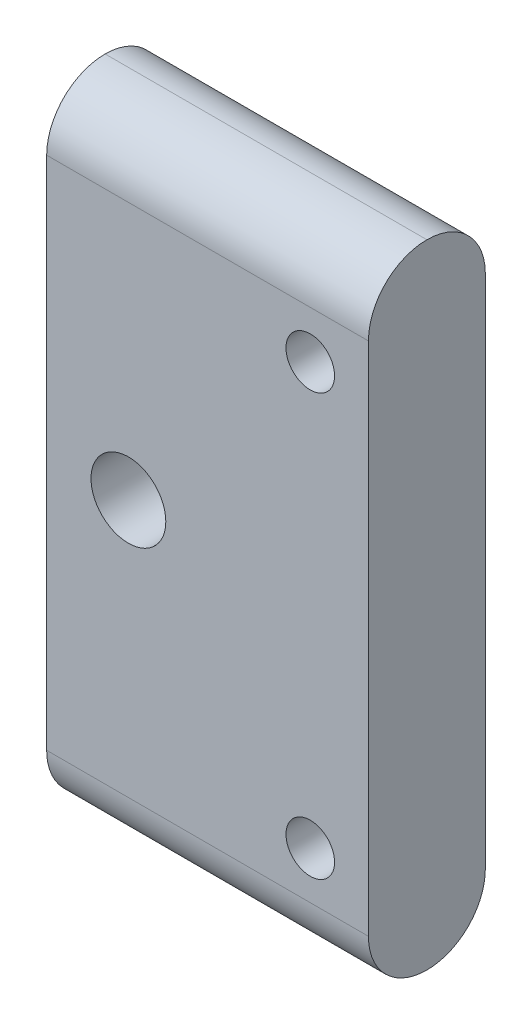
ISO-10303-21;
HEADER;
FILE_DESCRIPTION(('STEP AP214'),'2;1');
FILE_NAME('part.step','',(''),(''),'','','');
FILE_SCHEMA(('AUTOMOTIVE_DESIGN { 1 0 10303 214 1 1 1 1 }'));
ENDSEC;
DATA;
#1=APPLICATION_CONTEXT('core data for automotive mechanical design processes');
#2=APPLICATION_PROTOCOL_DEFINITION('international standard','automotive_design',2000,#1);
#3=PRODUCT_CONTEXT('',#1,'mechanical');
#4=PRODUCT('Part','Part','',(#3));
#5=PRODUCT_RELATED_PRODUCT_CATEGORY('part','',(#4));
#6=PRODUCT_DEFINITION_FORMATION('','',#4);
#7=PRODUCT_DEFINITION_CONTEXT('part definition',#1,'design');
#8=PRODUCT_DEFINITION('design','',#6,#7);
#9=PRODUCT_DEFINITION_SHAPE('','',#8);
#10=(LENGTH_UNIT() NAMED_UNIT(*) SI_UNIT(.MILLI.,.METRE.));
#11=(NAMED_UNIT(*) PLANE_ANGLE_UNIT() SI_UNIT($,.RADIAN.));
#12=(NAMED_UNIT(*) SI_UNIT($,.STERADIAN.) SOLID_ANGLE_UNIT());
#13=UNCERTAINTY_MEASURE_WITH_UNIT(LENGTH_MEASURE(1.E-05),#10,'distance_accuracy_value','');
#14=(GEOMETRIC_REPRESENTATION_CONTEXT(3) GLOBAL_UNCERTAINTY_ASSIGNED_CONTEXT((#13)) GLOBAL_UNIT_ASSIGNED_CONTEXT((#10,
#11,#12)) REPRESENTATION_CONTEXT('',''));
#15=CARTESIAN_POINT('',(0.,0.,0.));
#16=DIRECTION('',(0.,0.,1.));
#17=DIRECTION('',(1.,0.,0.));
#18=AXIS2_PLACEMENT_3D('',#15,#16,#17);
#19=CARTESIAN_POINT('',(174.8183702,174.2591892,-15.875));
#20=DIRECTION('',(1.,0.,0.));
#21=DIRECTION('',(0.,0.,-1.));
#22=AXIS2_PLACEMENT_3D('',#19,#20,#21);
#23=PLANE('',#22);
#24=CARTESIAN_POINT('',(174.8183702,96.296710524297,-7.9375));
#25=DIRECTION('',(1.,0.,0.));
#26=DIRECTION('',(0.,-1.,0.));
#27=AXIS2_PLACEMENT_3D('',#24,#25,#26);
#28=ELLIPSE('',#27,7.93750192429702,7.9375);
#29=CARTESIAN_POINT('',(174.8183702,96.296710524297,0.));
#30=VERTEX_POINT('',#29);
#31=CARTESIAN_POINT('',(174.8183702,88.3592086,-7.9375));
#32=VERTEX_POINT('',#31);
#33=EDGE_CURVE('E94',#30,#32,#28,.T.);
#34=ORIENTED_EDGE('',*,*,#33,.T.);
#35=CARTESIAN_POINT('',(174.8183702,96.296710524297,-7.9375));
#36=DIRECTION('',(1.,0.,0.));
#37=DIRECTION('',(0.,1.,0.));
#38=AXIS2_PLACEMENT_3D('',#35,#36,#37);
#39=ELLIPSE('',#38,7.93750192429702,7.9375);
#40=CARTESIAN_POINT('',(174.8183702,96.296710524297,-15.875));
#41=VERTEX_POINT('',#40);
#42=EDGE_CURVE('E104',#32,#41,#39,.T.);
#43=ORIENTED_EDGE('',*,*,#42,.T.);
#44=DIRECTION('',(0.,1.,0.));
#45=VECTOR('',#44,1.);
#46=CARTESIAN_POINT('',(174.8183702,174.2591892,-15.875));
#47=LINE('',#46,#45);
#48=CARTESIAN_POINT('',(174.8183702,166.3216892,-15.875));
#49=VERTEX_POINT('',#48);
#50=EDGE_CURVE('E135',#41,#49,#47,.T.);
#51=ORIENTED_EDGE('',*,*,#50,.T.);
#52=CARTESIAN_POINT('',(174.8183702,166.3216892,-7.9375));
#53=DIRECTION('',(1.,0.,0.));
#54=DIRECTION('',(0.,0.,-1.));
#55=AXIS2_PLACEMENT_3D('',#52,#53,#54);
#56=CIRCLE('',#55,7.9375);
#57=CARTESIAN_POINT('',(174.8183702,174.2591892,-7.9375));
#58=VERTEX_POINT('',#57);
#59=EDGE_CURVE('E105',#49,#58,#56,.T.);
#60=ORIENTED_EDGE('',*,*,#59,.T.);
#61=CARTESIAN_POINT('',(174.8183702,166.3216892,-7.9375));
#62=DIRECTION('',(1.,0.,0.));
#63=DIRECTION('',(0.,0.,-1.));
#64=AXIS2_PLACEMENT_3D('',#61,#62,#63);
#65=CIRCLE('',#64,7.9375);
#66=CARTESIAN_POINT('',(174.8183702,166.3216892,0.));
#67=VERTEX_POINT('',#66);
#68=EDGE_CURVE('E97',#58,#67,#65,.T.);
#69=ORIENTED_EDGE('',*,*,#68,.T.);
#70=DIRECTION('',(0.,1.,0.));
#71=VECTOR('',#70,1.);
#72=CARTESIAN_POINT('',(174.8183702,174.2591892,0.));
#73=LINE('',#72,#71);
#74=EDGE_CURVE('E88',#30,#67,#73,.T.);
#75=ORIENTED_EDGE('',*,*,#74,.F.);
#76=EDGE_LOOP('',(#34,#43,#51,#60,#69,#75));
#77=FACE_BOUND('',#76,.T.);
#78=ADVANCED_FACE('F31',(#77),#23,.T.);
#79=CARTESIAN_POINT('',(131.1183814,88.3896378,-15.875));
#80=DIRECTION('',(-1.,0.,0.));
#81=DIRECTION('',(0.,0.,1.));
#82=AXIS2_PLACEMENT_3D('',#79,#80,#81);
#83=PLANE('',#82);
#84=DIRECTION('',(0.,-1.,0.));
#85=VECTOR('',#84,1.);
#86=CARTESIAN_POINT('',(131.1183814,88.3896378,-15.875));
#87=LINE('',#86,#85);
#88=CARTESIAN_POINT('',(131.1183814,166.3216892,-15.875));
#89=VERTEX_POINT('',#88);
#90=CARTESIAN_POINT('',(131.1183814,96.327139724297,-15.875));
#91=VERTEX_POINT('',#90);
#92=EDGE_CURVE('E134',#89,#91,#87,.T.);
#93=ORIENTED_EDGE('',*,*,#92,.T.);
#94=CARTESIAN_POINT('',(131.1183814,96.327139724297,-7.9375));
#95=DIRECTION('',(-1.,0.,0.));
#96=DIRECTION('',(0.,1.,0.));
#97=AXIS2_PLACEMENT_3D('',#94,#95,#96);
#98=ELLIPSE('',#97,7.93750192429702,7.9375);
#99=CARTESIAN_POINT('',(131.1183814,88.3896378,-7.9375));
#100=VERTEX_POINT('',#99);
#101=EDGE_CURVE('E48',#91,#100,#98,.T.);
#102=ORIENTED_EDGE('',*,*,#101,.T.);
#103=CARTESIAN_POINT('',(131.1183814,96.327139724297,-7.9375));
#104=DIRECTION('',(-1.,0.,0.));
#105=DIRECTION('',(0.,-1.,0.));
#106=AXIS2_PLACEMENT_3D('',#103,#104,#105);
#107=ELLIPSE('',#106,7.93750192429702,7.9375);
#108=CARTESIAN_POINT('',(131.1183814,96.327139724297,0.));
#109=VERTEX_POINT('',#108);
#110=EDGE_CURVE('E120',#100,#109,#107,.T.);
#111=ORIENTED_EDGE('',*,*,#110,.T.);
#112=DIRECTION('',(0.,-1.,0.));
#113=VECTOR('',#112,1.);
#114=CARTESIAN_POINT('',(131.1183814,88.3896378,0.));
#115=LINE('',#114,#113);
#116=CARTESIAN_POINT('',(131.1183814,166.3216892,0.));
#117=VERTEX_POINT('',#116);
#118=EDGE_CURVE('E90',#117,#109,#115,.T.);
#119=ORIENTED_EDGE('',*,*,#118,.F.);
#120=CARTESIAN_POINT('',(131.1183814,166.3216892,-7.9375));
#121=DIRECTION('',(-1.,0.,0.));
#122=DIRECTION('',(0.,0.,1.));
#123=AXIS2_PLACEMENT_3D('',#120,#121,#122);
#124=CIRCLE('',#123,7.9375);
#125=CARTESIAN_POINT('',(131.1183814,174.2591892,-7.9375));
#126=VERTEX_POINT('',#125);
#127=EDGE_CURVE('E55',#117,#126,#124,.T.);
#128=ORIENTED_EDGE('',*,*,#127,.T.);
#129=CARTESIAN_POINT('',(131.1183814,166.3216892,-7.9375));
#130=DIRECTION('',(-1.,0.,0.));
#131=DIRECTION('',(0.,0.,1.));
#132=AXIS2_PLACEMENT_3D('',#129,#130,#131);
#133=CIRCLE('',#132,7.9375);
#134=EDGE_CURVE('E118',#126,#89,#133,.T.);
#135=ORIENTED_EDGE('',*,*,#134,.T.);
#136=EDGE_LOOP('',(#93,#102,#111,#119,#128,#135));
#137=FACE_BOUND('',#136,.T.);
#138=ADVANCED_FACE('F184',(#137),#83,.T.);
#139=CARTESIAN_POINT('',(174.8183702,174.2591892,-15.875));
#140=DIRECTION('',(0.,0.,1.));
#141=DIRECTION('',(1.,0.,0.));
#142=AXIS2_PLACEMENT_3D('',#139,#140,#141);
#143=PLANE('',#142);
#144=CARTESIAN_POINT('',(142.2181814,131.3091862,-15.875));
#145=DIRECTION('',(0.,0.,1.));
#146=DIRECTION('',(1.,0.,0.));
#147=AXIS2_PLACEMENT_3D('',#144,#145,#146);
#148=CIRCLE('',#147,5.07999999999999);
#149=CARTESIAN_POINT('',(147.2981814,131.3091862,-15.875));
#150=VERTEX_POINT('',#149);
#151=EDGE_CURVE('E126',#150,#150,#148,.T.);
#152=ORIENTED_EDGE('',*,*,#151,.T.);
#153=EDGE_LOOP('',(#152));
#154=FACE_BOUND('',#153,.T.);
#155=CARTESIAN_POINT('',(166.9183606,102.7091926,-15.875));
#156=DIRECTION('',(0.,0.,1.));
#157=DIRECTION('',(1.,0.,0.));
#158=AXIS2_PLACEMENT_3D('',#155,#156,#157);
#159=CIRCLE('',#158,3.3000188);
#160=CARTESIAN_POINT('',(170.2183794,102.7091926,-15.875));
#161=VERTEX_POINT('',#160);
#162=EDGE_CURVE('E144',#161,#161,#159,.T.);
#163=ORIENTED_EDGE('',*,*,#162,.T.);
#164=EDGE_LOOP('',(#163));
#165=FACE_BOUND('',#164,.T.);
#166=CARTESIAN_POINT('',(166.9183606,159.9092052,-15.875));
#167=DIRECTION('',(0.,0.,1.));
#168=DIRECTION('',(1.,0.,0.));
#169=AXIS2_PLACEMENT_3D('',#166,#167,#168);
#170=CIRCLE('',#169,3.3000188);
#171=CARTESIAN_POINT('',(170.2183794,159.9092052,-15.875));
#172=VERTEX_POINT('',#171);
#173=EDGE_CURVE('E98',#172,#172,#170,.T.);
#174=ORIENTED_EDGE('',*,*,#173,.T.);
#175=EDGE_LOOP('',(#174));
#176=FACE_BOUND('',#175,.T.);
#177=ORIENTED_EDGE('',*,*,#50,.F.);
#178=DIRECTION('',(0.999999757568938,-0.000696320375785036,0.));
#179=VECTOR('',#178,1.);
#180=CARTESIAN_POINT('',(131.123908442983,96.3271358757034,-15.875));
#181=LINE('',#180,#179);
#182=EDGE_CURVE('E114',#41,#91,#181,.F.);
#183=ORIENTED_EDGE('',*,*,#182,.T.);
#184=ORIENTED_EDGE('',*,*,#92,.F.);
#185=DIRECTION('',(-1.,0.,0.));
#186=VECTOR('',#185,1.);
#187=CARTESIAN_POINT('',(174.8183702,166.3216892,-15.875));
#188=LINE('',#187,#186);
#189=EDGE_CURVE('E107',#89,#49,#188,.F.);
#190=ORIENTED_EDGE('',*,*,#189,.T.);
#191=EDGE_LOOP('',(#177,#183,#184,#190));
#192=FACE_BOUND('',#191,.T.);
#193=ADVANCED_FACE('F155',(#154,#165,#176,#192),#143,.F.);
#194=CARTESIAN_POINT('',(174.8183702,174.2591892,0.));
#195=DIRECTION('',(0.,0.,1.));
#196=DIRECTION('',(1.,0.,0.));
#197=AXIS2_PLACEMENT_3D('',#194,#195,#196);
#198=PLANE('',#197);
#199=CARTESIAN_POINT('',(142.2181814,131.3091862,0.));
#200=DIRECTION('',(0.,0.,1.));
#201=DIRECTION('',(1.,0.,0.));
#202=AXIS2_PLACEMENT_3D('',#199,#200,#201);
#203=CIRCLE('',#202,5.07999999999999);
#204=CARTESIAN_POINT('',(147.2981814,131.3091862,0.));
#205=VERTEX_POINT('',#204);
#206=EDGE_CURVE('E123',#205,#205,#203,.T.);
#207=ORIENTED_EDGE('',*,*,#206,.F.);
#208=EDGE_LOOP('',(#207));
#209=FACE_BOUND('',#208,.T.);
#210=CARTESIAN_POINT('',(166.9183606,102.7091926,0.));
#211=DIRECTION('',(0.,0.,1.));
#212=DIRECTION('',(1.,0.,0.));
#213=AXIS2_PLACEMENT_3D('',#210,#211,#212);
#214=CIRCLE('',#213,3.3000188);
#215=CARTESIAN_POINT('',(170.2183794,102.7091926,0.));
#216=VERTEX_POINT('',#215);
#217=EDGE_CURVE('E147',#216,#216,#214,.T.);
#218=ORIENTED_EDGE('',*,*,#217,.F.);
#219=EDGE_LOOP('',(#218));
#220=FACE_BOUND('',#219,.T.);
#221=CARTESIAN_POINT('',(166.9183606,159.9092052,0.));
#222=DIRECTION('',(0.,0.,1.));
#223=DIRECTION('',(1.,0.,0.));
#224=AXIS2_PLACEMENT_3D('',#221,#222,#223);
#225=CIRCLE('',#224,3.3000188);
#226=CARTESIAN_POINT('',(170.2183794,159.9092052,0.));
#227=VERTEX_POINT('',#226);
#228=EDGE_CURVE('E141',#227,#227,#225,.T.);
#229=ORIENTED_EDGE('',*,*,#228,.F.);
#230=EDGE_LOOP('',(#229));
#231=FACE_BOUND('',#230,.T.);
#232=ORIENTED_EDGE('',*,*,#118,.T.);
#233=DIRECTION('',(0.999999757568938,-0.000696320375785036,0.));
#234=VECTOR('',#233,1.);
#235=CARTESIAN_POINT('',(174.764083350712,96.2967483253455,0.));
#236=LINE('',#235,#234);
#237=EDGE_CURVE('E11',#109,#30,#236,.T.);
#238=ORIENTED_EDGE('',*,*,#237,.T.);
#239=ORIENTED_EDGE('',*,*,#74,.T.);
#240=DIRECTION('',(-1.,0.,0.));
#241=VECTOR('',#240,1.);
#242=CARTESIAN_POINT('',(174.8183702,166.3216892,0.));
#243=LINE('',#242,#241);
#244=EDGE_CURVE('E40',#67,#117,#243,.T.);
#245=ORIENTED_EDGE('',*,*,#244,.T.);
#246=EDGE_LOOP('',(#232,#238,#239,#245));
#247=FACE_BOUND('',#246,.T.);
#248=ADVANCED_FACE('F87',(#209,#220,#231,#247),#198,.T.);
#249=CARTESIAN_POINT('',(166.9183606,159.9092052,-15.875));
#250=DIRECTION('',(0.,0.,1.));
#251=DIRECTION('',(1.,0.,0.));
#252=AXIS2_PLACEMENT_3D('',#249,#250,#251);
#253=CYLINDRICAL_SURFACE('',#252,3.3000188);
#254=ORIENTED_EDGE('',*,*,#173,.F.);
#255=EDGE_LOOP('',(#254));
#256=FACE_BOUND('',#255,.T.);
#257=ORIENTED_EDGE('',*,*,#228,.T.);
#258=EDGE_LOOP('',(#257));
#259=FACE_BOUND('',#258,.T.);
#260=ADVANCED_FACE('F167',(#256,#259),#253,.F.);
#261=CARTESIAN_POINT('',(166.9183606,102.7091926,-15.875));
#262=DIRECTION('',(0.,0.,1.));
#263=DIRECTION('',(1.,0.,0.));
#264=AXIS2_PLACEMENT_3D('',#261,#262,#263);
#265=CYLINDRICAL_SURFACE('',#264,3.3000188);
#266=ORIENTED_EDGE('',*,*,#162,.F.);
#267=EDGE_LOOP('',(#266));
#268=FACE_BOUND('',#267,.T.);
#269=ORIENTED_EDGE('',*,*,#217,.T.);
#270=EDGE_LOOP('',(#269));
#271=FACE_BOUND('',#270,.T.);
#272=ADVANCED_FACE('F161',(#268,#271),#265,.F.);
#273=CARTESIAN_POINT('',(142.2181814,131.3091862,-15.875));
#274=DIRECTION('',(0.,0.,1.));
#275=DIRECTION('',(1.,0.,0.));
#276=AXIS2_PLACEMENT_3D('',#273,#274,#275);
#277=CYLINDRICAL_SURFACE('',#276,5.07999999999999);
#278=ORIENTED_EDGE('',*,*,#151,.F.);
#279=EDGE_LOOP('',(#278));
#280=FACE_BOUND('',#279,.T.);
#281=ORIENTED_EDGE('',*,*,#206,.T.);
#282=EDGE_LOOP('',(#281));
#283=FACE_BOUND('',#282,.T.);
#284=ADVANCED_FACE('F158',(#280,#283),#277,.F.);
#285=CARTESIAN_POINT('',(174.764083350712,96.2967483253455,-7.9375));
#286=DIRECTION('',(0.999999757568938,-0.000696320375785036,0.));
#287=DIRECTION('',(0.000696320375785036,0.999999757568938,0.));
#288=AXIS2_PLACEMENT_3D('',#285,#286,#287);
#289=CYLINDRICAL_SURFACE('',#288,7.9375);
#290=ORIENTED_EDGE('',*,*,#237,.F.);
#291=ORIENTED_EDGE('',*,*,#110,.F.);
#292=DIRECTION('',(0.999999757568938,-0.000696320375785036,0.));
#293=VECTOR('',#292,1.);
#294=CARTESIAN_POINT('',(174.8183702,88.3592086,-7.9375));
#295=LINE('',#294,#293);
#296=EDGE_CURVE('E102',#32,#100,#295,.F.);
#297=ORIENTED_EDGE('',*,*,#296,.F.);
#298=ORIENTED_EDGE('',*,*,#33,.F.);
#299=EDGE_LOOP('',(#290,#291,#297,#298));
#300=FACE_BOUND('',#299,.T.);
#301=ADVANCED_FACE('F100',(#300),#289,.T.);
#302=CARTESIAN_POINT('',(174.823897242983,96.2967066757034,-7.9375));
#303=DIRECTION('',(-0.999999757568938,0.000696320375785036,0.));
#304=DIRECTION('',(-0.000696320375785036,-0.999999757568938,0.));
#305=AXIS2_PLACEMENT_3D('',#302,#303,#304);
#306=CYLINDRICAL_SURFACE('',#305,7.9375);
#307=ORIENTED_EDGE('',*,*,#101,.F.);
#308=ORIENTED_EDGE('',*,*,#182,.F.);
#309=ORIENTED_EDGE('',*,*,#42,.F.);
#310=ORIENTED_EDGE('',*,*,#296,.T.);
#311=EDGE_LOOP('',(#307,#308,#309,#310));
#312=FACE_BOUND('',#311,.T.);
#313=ADVANCED_FACE('F191',(#312),#306,.T.);
#314=CARTESIAN_POINT('',(174.8183702,166.3216892,-7.9375));
#315=DIRECTION('',(-1.,0.,0.));
#316=DIRECTION('',(0.,0.,1.));
#317=AXIS2_PLACEMENT_3D('',#314,#315,#316);
#318=CYLINDRICAL_SURFACE('',#317,7.9375);
#319=ORIENTED_EDGE('',*,*,#244,.F.);
#320=ORIENTED_EDGE('',*,*,#68,.F.);
#321=DIRECTION('',(-1.,0.,0.));
#322=VECTOR('',#321,1.);
#323=CARTESIAN_POINT('',(131.1183814,174.2591892,-7.9375));
#324=LINE('',#323,#322);
#325=EDGE_CURVE('E35',#126,#58,#324,.F.);
#326=ORIENTED_EDGE('',*,*,#325,.F.);
#327=ORIENTED_EDGE('',*,*,#127,.F.);
#328=EDGE_LOOP('',(#319,#320,#326,#327));
#329=FACE_BOUND('',#328,.T.);
#330=ADVANCED_FACE('F33',(#329),#318,.T.);
#331=CARTESIAN_POINT('',(131.1183814,166.3216892,-7.9375));
#332=DIRECTION('',(1.,0.,0.));
#333=DIRECTION('',(0.,0.,-1.));
#334=AXIS2_PLACEMENT_3D('',#331,#332,#333);
#335=CYLINDRICAL_SURFACE('',#334,7.9375);
#336=ORIENTED_EDGE('',*,*,#59,.F.);
#337=ORIENTED_EDGE('',*,*,#189,.F.);
#338=ORIENTED_EDGE('',*,*,#134,.F.);
#339=ORIENTED_EDGE('',*,*,#325,.T.);
#340=EDGE_LOOP('',(#336,#337,#338,#339));
#341=FACE_BOUND('',#340,.T.);
#342=ADVANCED_FACE('F131',(#341),#335,.T.);
#343=CLOSED_SHELL('',(#78,#138,#193,#248,#260,#272,#284,#301,#313,#330,#342));
#344=MANIFOLD_SOLID_BREP('B2',#343);
#345=ADVANCED_BREP_SHAPE_REPRESENTATION('',(#18,#344),#14);
#346=SHAPE_DEFINITION_REPRESENTATION(#9,#345);
ENDSEC;
END-ISO-10303-21;
